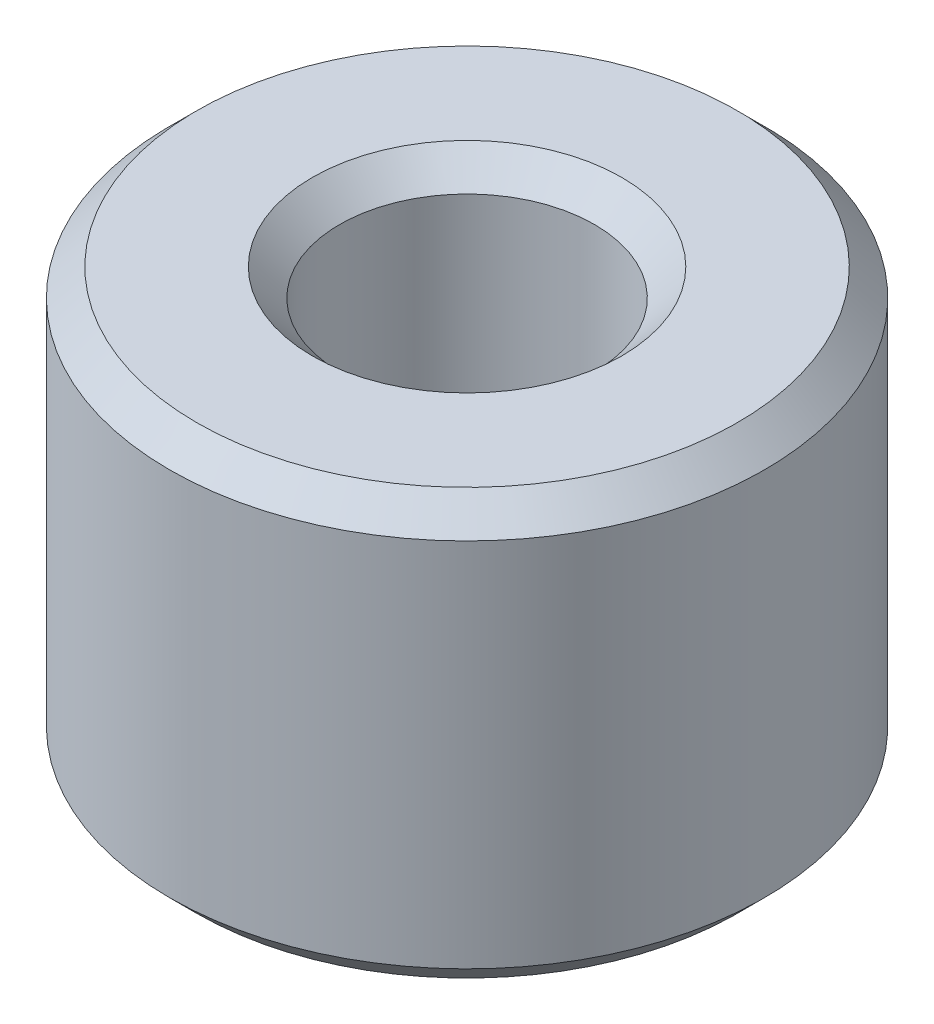
ISO-10303-21;
HEADER;
FILE_DESCRIPTION(('STEP AP214'),'2;1');
FILE_NAME('part.step','',(''),(''),'','','');
FILE_SCHEMA(('AUTOMOTIVE_DESIGN { 1 0 10303 214 1 1 1 1 }'));
ENDSEC;
DATA;
#1=APPLICATION_CONTEXT('core data for automotive mechanical design processes');
#2=APPLICATION_PROTOCOL_DEFINITION('international standard','automotive_design',2000,#1);
#3=PRODUCT_CONTEXT('',#1,'mechanical');
#4=PRODUCT('Part','Part','',(#3));
#5=PRODUCT_RELATED_PRODUCT_CATEGORY('part','',(#4));
#6=PRODUCT_DEFINITION_FORMATION('','',#4);
#7=PRODUCT_DEFINITION_CONTEXT('part definition',#1,'design');
#8=PRODUCT_DEFINITION('design','',#6,#7);
#9=PRODUCT_DEFINITION_SHAPE('','',#8);
#10=(LENGTH_UNIT() NAMED_UNIT(*) SI_UNIT(.MILLI.,.METRE.));
#11=(NAMED_UNIT(*) PLANE_ANGLE_UNIT() SI_UNIT($,.RADIAN.));
#12=(NAMED_UNIT(*) SI_UNIT($,.STERADIAN.) SOLID_ANGLE_UNIT());
#13=UNCERTAINTY_MEASURE_WITH_UNIT(LENGTH_MEASURE(1.E-05),#10,'distance_accuracy_value','');
#14=(GEOMETRIC_REPRESENTATION_CONTEXT(3) GLOBAL_UNCERTAINTY_ASSIGNED_CONTEXT((#13)) GLOBAL_UNIT_ASSIGNED_CONTEXT((#10,
#11,#12)) REPRESENTATION_CONTEXT('',''));
#15=CARTESIAN_POINT('',(0.,0.,0.));
#16=DIRECTION('',(0.,0.,1.));
#17=DIRECTION('',(1.,0.,0.));
#18=AXIS2_PLACEMENT_3D('',#15,#16,#17);
#19=CARTESIAN_POINT('',(0.,7.9374999999999,0.));
#20=DIRECTION('',(0.,1.00000000000001,0.));
#21=DIRECTION('',(0.,0.,0.999999999999992));
#22=AXIS2_PLACEMENT_3D('',#19,#20,#21);
#23=PLANE('',#22);
#24=CARTESIAN_POINT('',(0.,7.9374999999999,0.));
#25=DIRECTION('',(0.,1.00000000000001,0.));
#26=DIRECTION('',(0.,0.,0.999999999999992));
#27=AXIS2_PLACEMENT_3D('',#24,#25,#26);
#28=CIRCLE('',#27,2.88925);
#29=CARTESIAN_POINT('',(0.,7.9374999999999,2.88924999999995));
#30=VERTEX_POINT('',#29);
#31=EDGE_CURVE('E10',#30,#30,#28,.F.);
#32=ORIENTED_EDGE('',*,*,#31,.T.);
#33=EDGE_LOOP('',(#32));
#34=FACE_BOUND('',#33,.T.);
#35=CARTESIAN_POINT('',(0.,7.9374999999999,0.));
#36=DIRECTION('',(0.,1.00000000000001,0.));
#37=DIRECTION('',(0.,0.,0.999999999999992));
#38=AXIS2_PLACEMENT_3D('',#35,#36,#37);
#39=CIRCLE('',#38,5.04825);
#40=CARTESIAN_POINT('',(0.,7.9374999999999,5.04824999999993));
#41=VERTEX_POINT('',#40);
#42=EDGE_CURVE('E41',#41,#41,#39,.T.);
#43=ORIENTED_EDGE('',*,*,#42,.T.);
#44=EDGE_LOOP('',(#43));
#45=FACE_BOUND('',#44,.T.);
#46=ADVANCED_FACE('F34',(#34,#45),#23,.T.);
#47=CARTESIAN_POINT('',(0.,0.,0.));
#48=DIRECTION('',(0.,1.00000000000001,0.));
#49=DIRECTION('',(0.,0.,0.999999999999992));
#50=AXIS2_PLACEMENT_3D('',#47,#48,#49);
#51=PLANE('',#50);
#52=CARTESIAN_POINT('',(0.,0.,0.));
#53=DIRECTION('',(0.,1.00000000000001,0.));
#54=DIRECTION('',(0.,0.,0.999999999999992));
#55=AXIS2_PLACEMENT_3D('',#52,#53,#54);
#56=CIRCLE('',#55,2.88925);
#57=CARTESIAN_POINT('',(0.,0.,2.88924999999998));
#58=VERTEX_POINT('',#57);
#59=EDGE_CURVE('E60',#58,#58,#56,.T.);
#60=ORIENTED_EDGE('',*,*,#59,.T.);
#61=EDGE_LOOP('',(#60));
#62=FACE_BOUND('',#61,.T.);
#63=CARTESIAN_POINT('',(0.,0.,0.));
#64=DIRECTION('',(0.,1.00000000000001,0.));
#65=DIRECTION('',(0.,0.,0.999999999999992));
#66=AXIS2_PLACEMENT_3D('',#63,#64,#65);
#67=CIRCLE('',#66,5.04825);
#68=CARTESIAN_POINT('',(0.,0.,5.04824999999996));
#69=VERTEX_POINT('',#68);
#70=EDGE_CURVE('E63',#69,#69,#67,.F.);
#71=ORIENTED_EDGE('',*,*,#70,.T.);
#72=EDGE_LOOP('',(#71));
#73=FACE_BOUND('',#72,.T.);
#74=ADVANCED_FACE('F67',(#62,#73),#51,.F.);
#75=CARTESIAN_POINT('',(0.,7.9374999999999,0.));
#76=DIRECTION('',(0.,-1.00000000000001,0.));
#77=DIRECTION('',(0.,0.,-0.999999999999992));
#78=AXIS2_PLACEMENT_3D('',#75,#76,#77);
#79=CYLINDRICAL_SURFACE('',#78,5.55625);
#80=CARTESIAN_POINT('',(0.,0.50799999999962,1.66533453693773E-13));
#81=DIRECTION('',(0.,1.00000000000001,0.));
#82=DIRECTION('',(0.,0.,0.999999999999992));
#83=AXIS2_PLACEMENT_3D('',#80,#81,#82);
#84=CIRCLE('',#83,5.55625);
#85=CARTESIAN_POINT('',(0.,0.507999999999614,5.55625000000012));
#86=VERTEX_POINT('',#85);
#87=EDGE_CURVE('E45',#86,#86,#84,.T.);
#88=ORIENTED_EDGE('',*,*,#87,.T.);
#89=EDGE_LOOP('',(#88));
#90=FACE_BOUND('',#89,.T.);
#91=CARTESIAN_POINT('',(0.,7.42950000000001,-1.66533453693773E-13));
#92=DIRECTION('',(0.,1.00000000000001,0.));
#93=DIRECTION('',(0.,0.,0.999999999999992));
#94=AXIS2_PLACEMENT_3D('',#91,#92,#93);
#95=CIRCLE('',#94,5.55625);
#96=CARTESIAN_POINT('',(0.,7.4295,5.55624999999979));
#97=VERTEX_POINT('',#96);
#98=EDGE_CURVE('E49',#97,#97,#95,.F.);
#99=ORIENTED_EDGE('',*,*,#98,.T.);
#100=EDGE_LOOP('',(#99));
#101=FACE_BOUND('',#100,.T.);
#102=ADVANCED_FACE('F77',(#90,#101),#79,.T.);
#103=CARTESIAN_POINT('',(0.,7.9374999999999,0.));
#104=DIRECTION('',(0.,-1.00000000000001,0.));
#105=DIRECTION('',(0.,0.,-0.999999999999992));
#106=AXIS2_PLACEMENT_3D('',#103,#104,#105);
#107=CYLINDRICAL_SURFACE('',#106,2.38125);
#108=CARTESIAN_POINT('',(0.,0.50799999999962,1.66533453693773E-13));
#109=DIRECTION('',(0.,1.00000000000001,0.));
#110=DIRECTION('',(0.,0.,0.999999999999992));
#111=AXIS2_PLACEMENT_3D('',#108,#109,#110);
#112=CIRCLE('',#111,2.38125);
#113=CARTESIAN_POINT('',(0.,0.507999999999617,2.38125000000015));
#114=VERTEX_POINT('',#113);
#115=EDGE_CURVE('E54',#114,#114,#112,.F.);
#116=ORIENTED_EDGE('',*,*,#115,.T.);
#117=EDGE_LOOP('',(#116));
#118=FACE_BOUND('',#117,.T.);
#119=CARTESIAN_POINT('',(0.,7.42950000000001,-1.66533453693773E-13));
#120=DIRECTION('',(0.,1.00000000000001,0.));
#121=DIRECTION('',(0.,0.,0.999999999999992));
#122=AXIS2_PLACEMENT_3D('',#119,#120,#121);
#123=CIRCLE('',#122,2.38125);
#124=CARTESIAN_POINT('',(0.,7.4295,2.38124999999981));
#125=VERTEX_POINT('',#124);
#126=EDGE_CURVE('E57',#125,#125,#123,.T.);
#127=ORIENTED_EDGE('',*,*,#126,.T.);
#128=EDGE_LOOP('',(#127));
#129=FACE_BOUND('',#128,.T.);
#130=ADVANCED_FACE('F80',(#118,#129),#107,.F.);
#131=CARTESIAN_POINT('',(0.,0.,0.));
#132=DIRECTION('',(0.,-1.00000000000001,0.));
#133=DIRECTION('',(0.,0.,-0.999999999999992));
#134=AXIS2_PLACEMENT_3D('',#131,#132,#133);
#135=CONICAL_SURFACE('',#134,2.88925,0.785398163397447);
#136=ORIENTED_EDGE('',*,*,#115,.F.);
#137=EDGE_LOOP('',(#136));
#138=FACE_BOUND('',#137,.T.);
#139=ORIENTED_EDGE('',*,*,#59,.F.);
#140=EDGE_LOOP('',(#139));
#141=FACE_BOUND('',#140,.T.);
#142=ADVANCED_FACE('F73',(#138,#141),#135,.F.);
#143=CARTESIAN_POINT('',(0.,0.50799999999962,1.66533453693773E-13));
#144=DIRECTION('',(0.,1.00000000000001,0.));
#145=DIRECTION('',(0.,0.,0.999999999999992));
#146=AXIS2_PLACEMENT_3D('',#143,#144,#145);
#147=CONICAL_SURFACE('',#146,5.55625,0.785398163397449);
#148=ORIENTED_EDGE('',*,*,#70,.F.);
#149=EDGE_LOOP('',(#148));
#150=FACE_BOUND('',#149,.T.);
#151=ORIENTED_EDGE('',*,*,#87,.F.);
#152=EDGE_LOOP('',(#151));
#153=FACE_BOUND('',#152,.T.);
#154=ADVANCED_FACE('F69',(#150,#153),#147,.T.);
#155=CARTESIAN_POINT('',(0.,7.42950000000001,-1.66533453693773E-13));
#156=DIRECTION('',(0.,1.00000000000001,0.));
#157=DIRECTION('',(0.,0.,0.999999999999992));
#158=AXIS2_PLACEMENT_3D('',#155,#156,#157);
#159=CONICAL_SURFACE('',#158,2.38125,0.785398163397448);
#160=ORIENTED_EDGE('',*,*,#31,.F.);
#161=EDGE_LOOP('',(#160));
#162=FACE_BOUND('',#161,.T.);
#163=ORIENTED_EDGE('',*,*,#126,.F.);
#164=EDGE_LOOP('',(#163));
#165=FACE_BOUND('',#164,.T.);
#166=ADVANCED_FACE('F72',(#162,#165),#159,.F.);
#167=CARTESIAN_POINT('',(0.,7.9374999999999,0.));
#168=DIRECTION('',(0.,-1.00000000000001,0.));
#169=DIRECTION('',(0.,0.,-0.999999999999992));
#170=AXIS2_PLACEMENT_3D('',#167,#168,#169);
#171=CONICAL_SURFACE('',#170,5.04825,0.785398163397447);
#172=ORIENTED_EDGE('',*,*,#98,.F.);
#173=EDGE_LOOP('',(#172));
#174=FACE_BOUND('',#173,.T.);
#175=ORIENTED_EDGE('',*,*,#42,.F.);
#176=EDGE_LOOP('',(#175));
#177=FACE_BOUND('',#176,.T.);
#178=ADVANCED_FACE('F36',(#174,#177),#171,.T.);
#179=CLOSED_SHELL('',(#46,#74,#102,#130,#142,#154,#166,#178));
#180=MANIFOLD_SOLID_BREP('B2',#179);
#181=ADVANCED_BREP_SHAPE_REPRESENTATION('',(#18,#180),#14);
#182=SHAPE_DEFINITION_REPRESENTATION(#9,#181);
ENDSEC;
END-ISO-10303-21;
